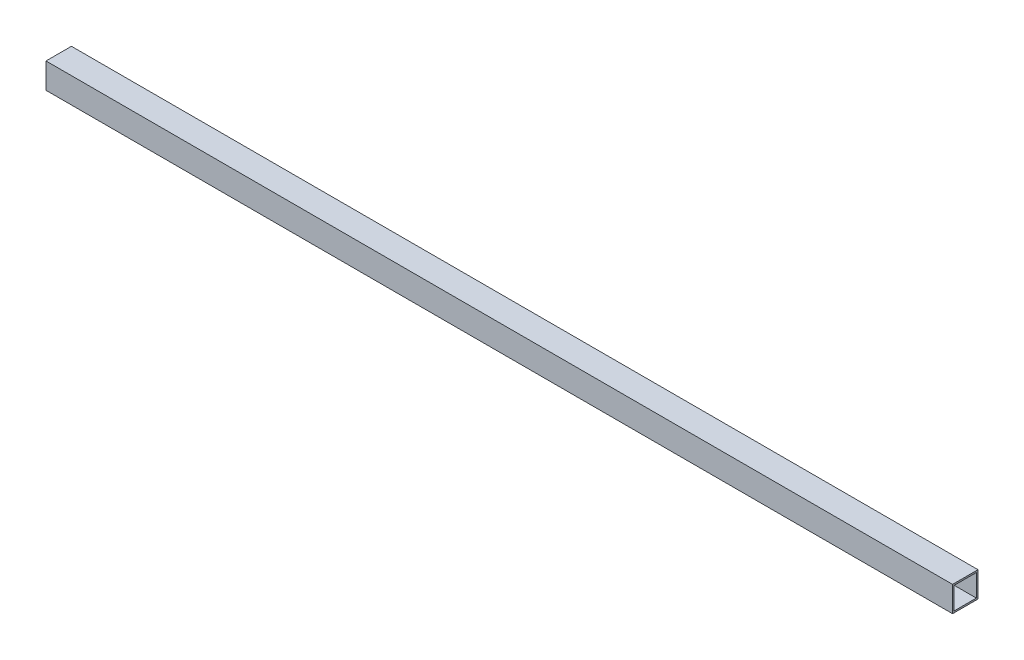
ISO-10303-21;
HEADER;
FILE_DESCRIPTION(('STEP AP214'),'2;1');
FILE_NAME('part.step','',(''),(''),'','','');
FILE_SCHEMA(('AUTOMOTIVE_DESIGN { 1 0 10303 214 1 1 1 1 }'));
ENDSEC;
DATA;
#1=APPLICATION_CONTEXT('core data for automotive mechanical design processes');
#2=APPLICATION_PROTOCOL_DEFINITION('international standard','automotive_design',2000,#1);
#3=PRODUCT_CONTEXT('',#1,'mechanical');
#4=PRODUCT('Part','Part','',(#3));
#5=PRODUCT_RELATED_PRODUCT_CATEGORY('part','',(#4));
#6=PRODUCT_DEFINITION_FORMATION('','',#4);
#7=PRODUCT_DEFINITION_CONTEXT('part definition',#1,'design');
#8=PRODUCT_DEFINITION('design','',#6,#7);
#9=PRODUCT_DEFINITION_SHAPE('','',#8);
#10=(LENGTH_UNIT() NAMED_UNIT(*) SI_UNIT(.MILLI.,.METRE.));
#11=(NAMED_UNIT(*) PLANE_ANGLE_UNIT() SI_UNIT($,.RADIAN.));
#12=(NAMED_UNIT(*) SI_UNIT($,.STERADIAN.) SOLID_ANGLE_UNIT());
#13=UNCERTAINTY_MEASURE_WITH_UNIT(LENGTH_MEASURE(1.E-05),#10,'distance_accuracy_value','');
#14=(GEOMETRIC_REPRESENTATION_CONTEXT(3) GLOBAL_UNCERTAINTY_ASSIGNED_CONTEXT((#13)) GLOBAL_UNIT_ASSIGNED_CONTEXT((#10,
#11,#12)) REPRESENTATION_CONTEXT('',''));
#15=CARTESIAN_POINT('',(0.,0.,0.));
#16=DIRECTION('',(0.,0.,1.));
#17=DIRECTION('',(1.,0.,0.));
#18=AXIS2_PLACEMENT_3D('',#15,#16,#17);
#19=CARTESIAN_POINT('',(905.4,12.7,12.7));
#20=DIRECTION('',(0.,-1.,0.));
#21=DIRECTION('',(0.,0.,-1.));
#22=AXIS2_PLACEMENT_3D('',#19,#20,#21);
#23=PLANE('',#22);
#24=DIRECTION('',(0.,0.,1.));
#25=VECTOR('',#24,1.);
#26=CARTESIAN_POINT('',(0.,12.7,12.7));
#27=LINE('',#26,#25);
#28=CARTESIAN_POINT('',(0.,12.7,-12.7));
#29=VERTEX_POINT('',#28);
#30=CARTESIAN_POINT('',(0.,12.7,12.7));
#31=VERTEX_POINT('',#30);
#32=EDGE_CURVE('E156',#29,#31,#27,.T.);
#33=ORIENTED_EDGE('',*,*,#32,.T.);
#34=DIRECTION('',(-1.,0.,0.));
#35=VECTOR('',#34,1.);
#36=CARTESIAN_POINT('',(905.4,12.7,12.7));
#37=LINE('',#36,#35);
#38=CARTESIAN_POINT('',(905.4,12.7,12.7));
#39=VERTEX_POINT('',#38);
#40=EDGE_CURVE('E12',#39,#31,#37,.T.);
#41=ORIENTED_EDGE('',*,*,#40,.F.);
#42=DIRECTION('',(0.,0.,1.));
#43=VECTOR('',#42,1.);
#44=CARTESIAN_POINT('',(905.4,12.7,12.7));
#45=LINE('',#44,#43);
#46=CARTESIAN_POINT('',(905.4,12.7,-12.7));
#47=VERTEX_POINT('',#46);
#48=EDGE_CURVE('E130',#47,#39,#45,.T.);
#49=ORIENTED_EDGE('',*,*,#48,.F.);
#50=DIRECTION('',(-1.,0.,0.));
#51=VECTOR('',#50,1.);
#52=CARTESIAN_POINT('',(905.4,12.7,-12.7));
#53=LINE('',#52,#51);
#54=EDGE_CURVE('E163',#47,#29,#53,.T.);
#55=ORIENTED_EDGE('',*,*,#54,.T.);
#56=EDGE_LOOP('',(#33,#41,#49,#55));
#57=FACE_BOUND('',#56,.T.);
#58=ADVANCED_FACE('F49',(#57),#23,.F.);
#59=CARTESIAN_POINT('',(905.4,12.7,12.7));
#60=DIRECTION('',(0.,0.,-1.));
#61=DIRECTION('',(-1.,0.,0.));
#62=AXIS2_PLACEMENT_3D('',#59,#60,#61);
#63=PLANE('',#62);
#64=DIRECTION('',(0.,-1.,0.));
#65=VECTOR('',#64,1.);
#66=CARTESIAN_POINT('',(0.,12.7,12.7));
#67=LINE('',#66,#65);
#68=CARTESIAN_POINT('',(0.,-12.7,12.7));
#69=VERTEX_POINT('',#68);
#70=EDGE_CURVE('E135',#31,#69,#67,.T.);
#71=ORIENTED_EDGE('',*,*,#70,.T.);
#72=DIRECTION('',(-1.,0.,0.));
#73=VECTOR('',#72,1.);
#74=CARTESIAN_POINT('',(905.4,-12.7,12.7));
#75=LINE('',#74,#73);
#76=CARTESIAN_POINT('',(905.4,-12.7,12.7));
#77=VERTEX_POINT('',#76);
#78=EDGE_CURVE('E59',#77,#69,#75,.T.);
#79=ORIENTED_EDGE('',*,*,#78,.F.);
#80=DIRECTION('',(0.,-1.,0.));
#81=VECTOR('',#80,1.);
#82=CARTESIAN_POINT('',(905.4,12.7,12.7));
#83=LINE('',#82,#81);
#84=EDGE_CURVE('E124',#39,#77,#83,.T.);
#85=ORIENTED_EDGE('',*,*,#84,.F.);
#86=ORIENTED_EDGE('',*,*,#40,.T.);
#87=EDGE_LOOP('',(#71,#79,#85,#86));
#88=FACE_BOUND('',#87,.T.);
#89=ADVANCED_FACE('F134',(#88),#63,.F.);
#90=CARTESIAN_POINT('',(905.4,-12.7,-12.7));
#91=DIRECTION('',(0.,1.,0.));
#92=DIRECTION('',(0.,0.,1.));
#93=AXIS2_PLACEMENT_3D('',#90,#91,#92);
#94=PLANE('',#93);
#95=DIRECTION('',(0.,0.,-1.));
#96=VECTOR('',#95,1.);
#97=CARTESIAN_POINT('',(0.,-12.7,-12.7));
#98=LINE('',#97,#96);
#99=CARTESIAN_POINT('',(0.,-12.7,-12.7));
#100=VERTEX_POINT('',#99);
#101=EDGE_CURVE('E97',#69,#100,#98,.T.);
#102=ORIENTED_EDGE('',*,*,#101,.T.);
#103=DIRECTION('',(-1.,0.,0.));
#104=VECTOR('',#103,1.);
#105=CARTESIAN_POINT('',(905.4,-12.7,-12.7));
#106=LINE('',#105,#104);
#107=CARTESIAN_POINT('',(905.4,-12.7,-12.7));
#108=VERTEX_POINT('',#107);
#109=EDGE_CURVE('E136',#108,#100,#106,.T.);
#110=ORIENTED_EDGE('',*,*,#109,.F.);
#111=DIRECTION('',(0.,0.,-1.));
#112=VECTOR('',#111,1.);
#113=CARTESIAN_POINT('',(905.4,-12.7,-12.7));
#114=LINE('',#113,#112);
#115=EDGE_CURVE('E128',#77,#108,#114,.T.);
#116=ORIENTED_EDGE('',*,*,#115,.F.);
#117=ORIENTED_EDGE('',*,*,#78,.T.);
#118=EDGE_LOOP('',(#102,#110,#116,#117));
#119=FACE_BOUND('',#118,.T.);
#120=ADVANCED_FACE('F138',(#119),#94,.F.);
#121=CARTESIAN_POINT('',(905.4,11.049,11.049));
#122=DIRECTION('',(0.,0.,-1.));
#123=DIRECTION('',(-1.,0.,0.));
#124=AXIS2_PLACEMENT_3D('',#121,#122,#123);
#125=PLANE('',#124);
#126=DIRECTION('',(0.,-1.,0.));
#127=VECTOR('',#126,1.);
#128=CARTESIAN_POINT('',(0.,11.049,11.049));
#129=LINE('',#128,#127);
#130=CARTESIAN_POINT('',(0.,11.049,11.049));
#131=VERTEX_POINT('',#130);
#132=CARTESIAN_POINT('',(0.,-11.049,11.049));
#133=VERTEX_POINT('',#132);
#134=EDGE_CURVE('E144',#131,#133,#129,.T.);
#135=ORIENTED_EDGE('',*,*,#134,.F.);
#136=DIRECTION('',(-1.,0.,0.));
#137=VECTOR('',#136,1.);
#138=CARTESIAN_POINT('',(905.4,11.049,11.049));
#139=LINE('',#138,#137);
#140=CARTESIAN_POINT('',(905.4,11.049,11.049));
#141=VERTEX_POINT('',#140);
#142=EDGE_CURVE('E53',#141,#131,#139,.T.);
#143=ORIENTED_EDGE('',*,*,#142,.F.);
#144=DIRECTION('',(0.,-1.,0.));
#145=VECTOR('',#144,1.);
#146=CARTESIAN_POINT('',(905.4,11.049,11.049));
#147=LINE('',#146,#145);
#148=CARTESIAN_POINT('',(905.4,-11.049,11.049));
#149=VERTEX_POINT('',#148);
#150=EDGE_CURVE('E162',#141,#149,#147,.T.);
#151=ORIENTED_EDGE('',*,*,#150,.T.);
#152=DIRECTION('',(-1.,0.,0.));
#153=VECTOR('',#152,1.);
#154=CARTESIAN_POINT('',(905.4,-11.049,11.049));
#155=LINE('',#154,#153);
#156=EDGE_CURVE('E140',#149,#133,#155,.T.);
#157=ORIENTED_EDGE('',*,*,#156,.T.);
#158=EDGE_LOOP('',(#135,#143,#151,#157));
#159=FACE_BOUND('',#158,.T.);
#160=ADVANCED_FACE('F51',(#159),#125,.T.);
#161=CARTESIAN_POINT('',(905.4,11.049,11.049));
#162=DIRECTION('',(0.,-1.,0.));
#163=DIRECTION('',(0.,0.,-1.));
#164=AXIS2_PLACEMENT_3D('',#161,#162,#163);
#165=PLANE('',#164);
#166=DIRECTION('',(0.,0.,1.));
#167=VECTOR('',#166,1.);
#168=CARTESIAN_POINT('',(0.,11.049,11.049));
#169=LINE('',#168,#167);
#170=CARTESIAN_POINT('',(0.,11.049,-11.049));
#171=VERTEX_POINT('',#170);
#172=EDGE_CURVE('E147',#171,#131,#169,.T.);
#173=ORIENTED_EDGE('',*,*,#172,.F.);
#174=DIRECTION('',(-1.,0.,0.));
#175=VECTOR('',#174,1.);
#176=CARTESIAN_POINT('',(905.4,11.049,-11.049));
#177=LINE('',#176,#175);
#178=CARTESIAN_POINT('',(905.4,11.049,-11.049));
#179=VERTEX_POINT('',#178);
#180=EDGE_CURVE('E168',#179,#171,#177,.T.);
#181=ORIENTED_EDGE('',*,*,#180,.F.);
#182=DIRECTION('',(0.,0.,1.));
#183=VECTOR('',#182,1.);
#184=CARTESIAN_POINT('',(905.4,11.049,11.049));
#185=LINE('',#184,#183);
#186=EDGE_CURVE('E177',#179,#141,#185,.T.);
#187=ORIENTED_EDGE('',*,*,#186,.T.);
#188=ORIENTED_EDGE('',*,*,#142,.T.);
#189=EDGE_LOOP('',(#173,#181,#187,#188));
#190=FACE_BOUND('',#189,.T.);
#191=ADVANCED_FACE('F175',(#190),#165,.T.);
#192=CARTESIAN_POINT('',(905.4,-11.049,-11.049));
#193=DIRECTION('',(0.,0.,1.));
#194=DIRECTION('',(1.,0.,0.));
#195=AXIS2_PLACEMENT_3D('',#192,#193,#194);
#196=PLANE('',#195);
#197=DIRECTION('',(0.,1.,0.));
#198=VECTOR('',#197,1.);
#199=CARTESIAN_POINT('',(0.,-11.049,-11.049));
#200=LINE('',#199,#198);
#201=CARTESIAN_POINT('',(0.,-11.049,-11.049));
#202=VERTEX_POINT('',#201);
#203=EDGE_CURVE('E150',#202,#171,#200,.T.);
#204=ORIENTED_EDGE('',*,*,#203,.F.);
#205=DIRECTION('',(-1.,0.,0.));
#206=VECTOR('',#205,1.);
#207=CARTESIAN_POINT('',(905.4,-11.049,-11.049));
#208=LINE('',#207,#206);
#209=CARTESIAN_POINT('',(905.4,-11.049,-11.049));
#210=VERTEX_POINT('',#209);
#211=EDGE_CURVE('E167',#210,#202,#208,.T.);
#212=ORIENTED_EDGE('',*,*,#211,.F.);
#213=DIRECTION('',(0.,1.,0.));
#214=VECTOR('',#213,1.);
#215=CARTESIAN_POINT('',(905.4,-11.049,-11.049));
#216=LINE('',#215,#214);
#217=EDGE_CURVE('E184',#210,#179,#216,.T.);
#218=ORIENTED_EDGE('',*,*,#217,.T.);
#219=ORIENTED_EDGE('',*,*,#180,.T.);
#220=EDGE_LOOP('',(#204,#212,#218,#219));
#221=FACE_BOUND('',#220,.T.);
#222=ADVANCED_FACE('F182',(#221),#196,.T.);
#223=CARTESIAN_POINT('',(905.4,-11.049,-11.049));
#224=DIRECTION('',(0.,1.,0.));
#225=DIRECTION('',(0.,0.,1.));
#226=AXIS2_PLACEMENT_3D('',#223,#224,#225);
#227=PLANE('',#226);
#228=DIRECTION('',(0.,0.,-1.));
#229=VECTOR('',#228,1.);
#230=CARTESIAN_POINT('',(0.,-11.049,-11.049));
#231=LINE('',#230,#229);
#232=EDGE_CURVE('E153',#133,#202,#231,.T.);
#233=ORIENTED_EDGE('',*,*,#232,.F.);
#234=ORIENTED_EDGE('',*,*,#156,.F.);
#235=DIRECTION('',(0.,0.,-1.));
#236=VECTOR('',#235,1.);
#237=CARTESIAN_POINT('',(905.4,-11.049,-11.049));
#238=LINE('',#237,#236);
#239=EDGE_CURVE('E189',#149,#210,#238,.T.);
#240=ORIENTED_EDGE('',*,*,#239,.T.);
#241=ORIENTED_EDGE('',*,*,#211,.T.);
#242=EDGE_LOOP('',(#233,#234,#240,#241));
#243=FACE_BOUND('',#242,.T.);
#244=ADVANCED_FACE('F191',(#243),#227,.T.);
#245=CARTESIAN_POINT('',(905.4,-12.7,-12.7));
#246=DIRECTION('',(0.,0.,1.));
#247=DIRECTION('',(0.,-1.,0.));
#248=AXIS2_PLACEMENT_3D('',#245,#246,#247);
#249=PLANE('',#248);
#250=DIRECTION('',(0.,1.,0.));
#251=VECTOR('',#250,1.);
#252=CARTESIAN_POINT('',(0.,-12.7,-12.7));
#253=LINE('',#252,#251);
#254=EDGE_CURVE('E103',#100,#29,#253,.T.);
#255=ORIENTED_EDGE('',*,*,#254,.T.);
#256=ORIENTED_EDGE('',*,*,#54,.F.);
#257=DIRECTION('',(0.,1.,0.));
#258=VECTOR('',#257,1.);
#259=CARTESIAN_POINT('',(905.4,-12.7,-12.7));
#260=LINE('',#259,#258);
#261=EDGE_CURVE('E68',#108,#47,#260,.T.);
#262=ORIENTED_EDGE('',*,*,#261,.F.);
#263=ORIENTED_EDGE('',*,*,#109,.T.);
#264=EDGE_LOOP('',(#255,#256,#262,#263));
#265=FACE_BOUND('',#264,.T.);
#266=ADVANCED_FACE('F196',(#265),#249,.F.);
#267=CARTESIAN_POINT('',(905.4,0.,0.));
#268=DIRECTION('',(1.,0.,0.));
#269=DIRECTION('',(0.,0.,-1.));
#270=AXIS2_PLACEMENT_3D('',#267,#268,#269);
#271=PLANE('',#270);
#272=ORIENTED_EDGE('',*,*,#150,.F.);
#273=ORIENTED_EDGE('',*,*,#186,.F.);
#274=ORIENTED_EDGE('',*,*,#217,.F.);
#275=ORIENTED_EDGE('',*,*,#239,.F.);
#276=EDGE_LOOP('',(#272,#273,#274,#275));
#277=FACE_BOUND('',#276,.T.);
#278=ORIENTED_EDGE('',*,*,#48,.T.);
#279=ORIENTED_EDGE('',*,*,#84,.T.);
#280=ORIENTED_EDGE('',*,*,#115,.T.);
#281=ORIENTED_EDGE('',*,*,#261,.T.);
#282=EDGE_LOOP('',(#278,#279,#280,#281));
#283=FACE_BOUND('',#282,.T.);
#284=ADVANCED_FACE('F126',(#277,#283),#271,.T.);
#285=CARTESIAN_POINT('',(0.,0.,0.));
#286=DIRECTION('',(1.,0.,0.));
#287=DIRECTION('',(0.,0.,-1.));
#288=AXIS2_PLACEMENT_3D('',#285,#286,#287);
#289=PLANE('',#288);
#290=ORIENTED_EDGE('',*,*,#134,.T.);
#291=ORIENTED_EDGE('',*,*,#232,.T.);
#292=ORIENTED_EDGE('',*,*,#203,.T.);
#293=ORIENTED_EDGE('',*,*,#172,.T.);
#294=EDGE_LOOP('',(#290,#291,#292,#293));
#295=FACE_BOUND('',#294,.T.);
#296=ORIENTED_EDGE('',*,*,#32,.F.);
#297=ORIENTED_EDGE('',*,*,#254,.F.);
#298=ORIENTED_EDGE('',*,*,#101,.F.);
#299=ORIENTED_EDGE('',*,*,#70,.F.);
#300=EDGE_LOOP('',(#296,#297,#298,#299));
#301=FACE_BOUND('',#300,.T.);
#302=ADVANCED_FACE('F180',(#295,#301),#289,.F.);
#303=CLOSED_SHELL('',(#58,#89,#120,#160,#191,#222,#244,#266,#284,#302));
#304=MANIFOLD_SOLID_BREP('B2',#303);
#305=ADVANCED_BREP_SHAPE_REPRESENTATION('',(#18,#304),#14);
#306=SHAPE_DEFINITION_REPRESENTATION(#9,#305);
ENDSEC;
END-ISO-10303-21;
